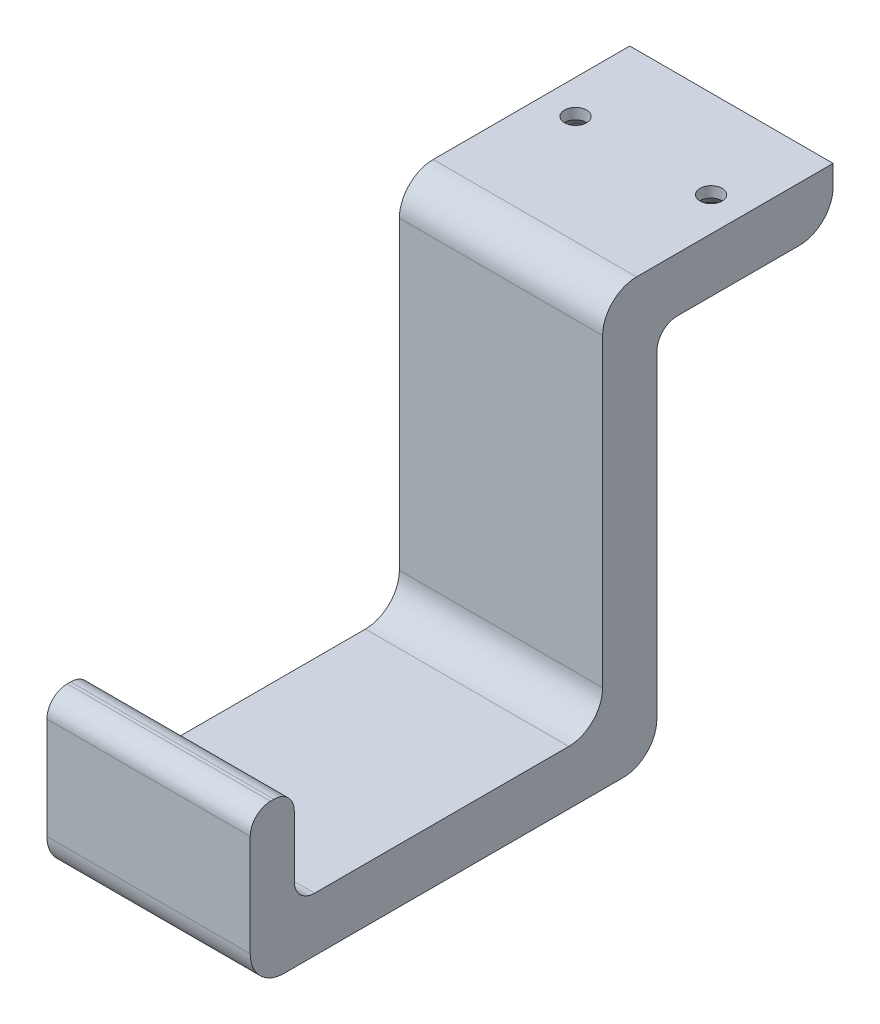
ISO-10303-21;
HEADER;
FILE_DESCRIPTION(('STEP AP214'),'2;1');
FILE_NAME('part.step','',(''),(''),'','','');
FILE_SCHEMA(('AUTOMOTIVE_DESIGN { 1 0 10303 214 1 1 1 1 }'));
ENDSEC;
DATA;
#1=APPLICATION_CONTEXT('core data for automotive mechanical design processes');
#2=APPLICATION_PROTOCOL_DEFINITION('international standard','automotive_design',2000,#1);
#3=PRODUCT_CONTEXT('',#1,'mechanical');
#4=PRODUCT('Part','Part','',(#3));
#5=PRODUCT_RELATED_PRODUCT_CATEGORY('part','',(#4));
#6=PRODUCT_DEFINITION_FORMATION('','',#4);
#7=PRODUCT_DEFINITION_CONTEXT('part definition',#1,'design');
#8=PRODUCT_DEFINITION('design','',#6,#7);
#9=PRODUCT_DEFINITION_SHAPE('','',#8);
#10=(LENGTH_UNIT() NAMED_UNIT(*) SI_UNIT(.MILLI.,.METRE.));
#11=(NAMED_UNIT(*) PLANE_ANGLE_UNIT() SI_UNIT($,.RADIAN.));
#12=(NAMED_UNIT(*) SI_UNIT($,.STERADIAN.) SOLID_ANGLE_UNIT());
#13=UNCERTAINTY_MEASURE_WITH_UNIT(LENGTH_MEASURE(1.E-05),#10,'distance_accuracy_value','');
#14=(GEOMETRIC_REPRESENTATION_CONTEXT(3) GLOBAL_UNCERTAINTY_ASSIGNED_CONTEXT((#13)) GLOBAL_UNIT_ASSIGNED_CONTEXT((#10,
#11,#12)) REPRESENTATION_CONTEXT('',''));
#15=CARTESIAN_POINT('',(0.,0.,0.));
#16=DIRECTION('',(0.,0.,1.));
#17=DIRECTION('',(1.,0.,0.));
#18=AXIS2_PLACEMENT_3D('',#15,#16,#17);
#19=CARTESIAN_POINT('',(15.,0.,60.));
#20=DIRECTION('',(0.,0.,-1.));
#21=DIRECTION('',(-1.,0.,0.));
#22=AXIS2_PLACEMENT_3D('',#19,#20,#21);
#23=PLANE('',#22);
#24=DIRECTION('',(0.,-1.,0.));
#25=VECTOR('',#24,1.);
#26=CARTESIAN_POINT('',(15.,0.,60.));
#27=LINE('',#26,#25);
#28=CARTESIAN_POINT('',(15.,20.,60.));
#29=VERTEX_POINT('',#28);
#30=CARTESIAN_POINT('',(15.,5.,60.));
#31=VERTEX_POINT('',#30);
#32=EDGE_CURVE('E232',#29,#31,#27,.T.);
#33=ORIENTED_EDGE('',*,*,#32,.F.);
#34=DIRECTION('',(-1.,0.,0.));
#35=VECTOR('',#34,1.);
#36=CARTESIAN_POINT('',(15.,20.,60.));
#37=LINE('',#36,#35);
#38=CARTESIAN_POINT('',(-15.,20.,60.));
#39=VERTEX_POINT('',#38);
#40=EDGE_CURVE('E304',#29,#39,#37,.T.);
#41=ORIENTED_EDGE('',*,*,#40,.T.);
#42=DIRECTION('',(0.,-1.,0.));
#43=VECTOR('',#42,1.);
#44=CARTESIAN_POINT('',(-15.,0.,60.));
#45=LINE('',#44,#43);
#46=CARTESIAN_POINT('',(-15.,5.,60.));
#47=VERTEX_POINT('',#46);
#48=EDGE_CURVE('E208',#39,#47,#45,.T.);
#49=ORIENTED_EDGE('',*,*,#48,.T.);
#50=DIRECTION('',(-1.,0.,0.));
#51=VECTOR('',#50,1.);
#52=CARTESIAN_POINT('',(15.,5.,60.));
#53=LINE('',#52,#51);
#54=EDGE_CURVE('E273',#47,#31,#53,.F.);
#55=ORIENTED_EDGE('',*,*,#54,.T.);
#56=EDGE_LOOP('',(#33,#41,#49,#55));
#57=FACE_BOUND('',#56,.T.);
#58=ADVANCED_FACE('F39',(#57),#23,.F.);
#59=CARTESIAN_POINT('',(15.,0.,60.));
#60=DIRECTION('',(0.,1.,0.));
#61=DIRECTION('',(0.,0.,1.));
#62=AXIS2_PLACEMENT_3D('',#59,#60,#61);
#63=PLANE('',#62);
#64=DIRECTION('',(0.,0.,-1.));
#65=VECTOR('',#64,1.);
#66=CARTESIAN_POINT('',(-15.,0.,60.));
#67=LINE('',#66,#65);
#68=CARTESIAN_POINT('',(-15.,0.,55.));
#69=VERTEX_POINT('',#68);
#70=CARTESIAN_POINT('',(-15.,0.,5.));
#71=VERTEX_POINT('',#70);
#72=EDGE_CURVE('E215',#69,#71,#67,.T.);
#73=ORIENTED_EDGE('',*,*,#72,.T.);
#74=DIRECTION('',(-1.,0.,0.));
#75=VECTOR('',#74,1.);
#76=CARTESIAN_POINT('',(15.,0.,5.));
#77=LINE('',#76,#75);
#78=CARTESIAN_POINT('',(15.,0.,5.));
#79=VERTEX_POINT('',#78);
#80=EDGE_CURVE('E271',#71,#79,#77,.F.);
#81=ORIENTED_EDGE('',*,*,#80,.T.);
#82=DIRECTION('',(0.,0.,-1.));
#83=VECTOR('',#82,1.);
#84=CARTESIAN_POINT('',(15.,0.,60.));
#85=LINE('',#84,#83);
#86=CARTESIAN_POINT('',(15.,0.,55.));
#87=VERTEX_POINT('',#86);
#88=EDGE_CURVE('E330',#87,#79,#85,.T.);
#89=ORIENTED_EDGE('',*,*,#88,.F.);
#90=DIRECTION('',(-1.,0.,0.));
#91=VECTOR('',#90,1.);
#92=CARTESIAN_POINT('',(15.,0.,55.));
#93=LINE('',#92,#91);
#94=EDGE_CURVE('E269',#87,#69,#93,.T.);
#95=ORIENTED_EDGE('',*,*,#94,.T.);
#96=EDGE_LOOP('',(#73,#81,#89,#95));
#97=FACE_BOUND('',#96,.T.);
#98=ADVANCED_FACE('F383',(#97),#63,.F.);
#99=CARTESIAN_POINT('',(15.,0.,0.));
#100=DIRECTION('',(0.,0.,1.));
#101=DIRECTION('',(0.,-1.,0.));
#102=AXIS2_PLACEMENT_3D('',#99,#100,#101);
#103=PLANE('',#102);
#104=DIRECTION('',(0.,1.,0.));
#105=VECTOR('',#104,1.);
#106=CARTESIAN_POINT('',(-15.,0.,0.));
#107=LINE('',#106,#105);
#108=CARTESIAN_POINT('',(-15.,5.,0.));
#109=VERTEX_POINT('',#108);
#110=CARTESIAN_POINT('',(-15.,52.,0.));
#111=VERTEX_POINT('',#110);
#112=EDGE_CURVE('E216',#109,#111,#107,.T.);
#113=ORIENTED_EDGE('',*,*,#112,.T.);
#114=DIRECTION('',(-1.,0.,0.));
#115=VECTOR('',#114,1.);
#116=CARTESIAN_POINT('',(15.,52.,0.));
#117=LINE('',#116,#115);
#118=CARTESIAN_POINT('',(15.,52.,0.));
#119=VERTEX_POINT('',#118);
#120=EDGE_CURVE('E292',#111,#119,#117,.F.);
#121=ORIENTED_EDGE('',*,*,#120,.T.);
#122=DIRECTION('',(0.,1.,0.));
#123=VECTOR('',#122,1.);
#124=CARTESIAN_POINT('',(15.,0.,0.));
#125=LINE('',#124,#123);
#126=CARTESIAN_POINT('',(15.,5.,0.));
#127=VERTEX_POINT('',#126);
#128=EDGE_CURVE('E326',#127,#119,#125,.T.);
#129=ORIENTED_EDGE('',*,*,#128,.F.);
#130=DIRECTION('',(-1.,0.,0.));
#131=VECTOR('',#130,1.);
#132=CARTESIAN_POINT('',(15.,5.,0.));
#133=LINE('',#132,#131);
#134=EDGE_CURVE('E270',#127,#109,#133,.T.);
#135=ORIENTED_EDGE('',*,*,#134,.T.);
#136=EDGE_LOOP('',(#113,#121,#129,#135));
#137=FACE_BOUND('',#136,.T.);
#138=ADVANCED_FACE('F316',(#137),#103,.F.);
#139=CARTESIAN_POINT('',(15.,55.,0.));
#140=DIRECTION('',(0.,1.,0.));
#141=DIRECTION('',(0.,0.,1.));
#142=AXIS2_PLACEMENT_3D('',#139,#140,#141);
#143=PLANE('',#142);
#144=CARTESIAN_POINT('',(-10.,55.,-13.));
#145=DIRECTION('',(0.,-1.,0.));
#146=DIRECTION('',(0.,0.,-1.));
#147=AXIS2_PLACEMENT_3D('',#144,#145,#146);
#148=CIRCLE('',#147,2.857501397);
#149=CARTESIAN_POINT('',(-10.,55.,-15.857501397));
#150=VERTEX_POINT('',#149);
#151=EDGE_CURVE('E358',#150,#150,#148,.T.);
#152=ORIENTED_EDGE('',*,*,#151,.F.);
#153=EDGE_LOOP('',(#152));
#154=FACE_BOUND('',#153,.T.);
#155=CARTESIAN_POINT('',(10.,55.,-13.));
#156=DIRECTION('',(0.,-1.,0.));
#157=DIRECTION('',(0.,0.,-1.));
#158=AXIS2_PLACEMENT_3D('',#155,#156,#157);
#159=CIRCLE('',#158,2.857501397);
#160=CARTESIAN_POINT('',(10.,55.,-15.857501397));
#161=VERTEX_POINT('',#160);
#162=EDGE_CURVE('E341',#161,#161,#159,.T.);
#163=ORIENTED_EDGE('',*,*,#162,.F.);
#164=EDGE_LOOP('',(#163));
#165=FACE_BOUND('',#164,.T.);
#166=DIRECTION('',(0.,0.,-1.));
#167=VECTOR('',#166,1.);
#168=CARTESIAN_POINT('',(15.,55.,0.));
#169=LINE('',#168,#167);
#170=CARTESIAN_POINT('',(15.,55.,-3.));
#171=VERTEX_POINT('',#170);
#172=CARTESIAN_POINT('',(15.,55.,-21.));
#173=VERTEX_POINT('',#172);
#174=EDGE_CURVE('E185',#171,#173,#169,.T.);
#175=ORIENTED_EDGE('',*,*,#174,.F.);
#176=DIRECTION('',(-1.,0.,0.));
#177=VECTOR('',#176,1.);
#178=CARTESIAN_POINT('',(-15.,55.,-3.));
#179=LINE('',#178,#177);
#180=CARTESIAN_POINT('',(-15.,55.,-3.));
#181=VERTEX_POINT('',#180);
#182=EDGE_CURVE('E287',#171,#181,#179,.T.);
#183=ORIENTED_EDGE('',*,*,#182,.T.);
#184=DIRECTION('',(0.,0.,-1.));
#185=VECTOR('',#184,1.);
#186=CARTESIAN_POINT('',(-15.,55.,0.));
#187=LINE('',#186,#185);
#188=CARTESIAN_POINT('',(-15.,55.,-21.));
#189=VERTEX_POINT('',#188);
#190=EDGE_CURVE('E218',#181,#189,#187,.T.);
#191=ORIENTED_EDGE('',*,*,#190,.T.);
#192=DIRECTION('',(-1.,0.,0.));
#193=VECTOR('',#192,1.);
#194=CARTESIAN_POINT('',(15.,55.,-21.));
#195=LINE('',#194,#193);
#196=EDGE_CURVE('E257',#189,#173,#195,.F.);
#197=ORIENTED_EDGE('',*,*,#196,.T.);
#198=EDGE_LOOP('',(#175,#183,#191,#197));
#199=FACE_BOUND('',#198,.T.);
#200=ADVANCED_FACE('F329',(#154,#165,#199),#143,.F.);
#201=CARTESIAN_POINT('',(15.,63.,-26.));
#202=DIRECTION('',(0.,0.,1.));
#203=DIRECTION('',(1.,0.,0.));
#204=AXIS2_PLACEMENT_3D('',#201,#202,#203);
#205=PLANE('',#204);
#206=DIRECTION('',(0.,1.,0.));
#207=VECTOR('',#206,1.);
#208=CARTESIAN_POINT('',(15.,63.,-26.));
#209=LINE('',#208,#207);
#210=CARTESIAN_POINT('',(15.,60.,-26.));
#211=VERTEX_POINT('',#210);
#212=CARTESIAN_POINT('',(15.,63.,-26.));
#213=VERTEX_POINT('',#212);
#214=EDGE_CURVE('E167',#211,#213,#209,.T.);
#215=ORIENTED_EDGE('',*,*,#214,.F.);
#216=DIRECTION('',(-1.,0.,0.));
#217=VECTOR('',#216,1.);
#218=CARTESIAN_POINT('',(15.,60.,-26.));
#219=LINE('',#218,#217);
#220=CARTESIAN_POINT('',(-15.,60.,-26.));
#221=VERTEX_POINT('',#220);
#222=EDGE_CURVE('E242',#211,#221,#219,.T.);
#223=ORIENTED_EDGE('',*,*,#222,.T.);
#224=DIRECTION('',(0.,1.,0.));
#225=VECTOR('',#224,1.);
#226=CARTESIAN_POINT('',(-15.,63.,-26.));
#227=LINE('',#226,#225);
#228=CARTESIAN_POINT('',(-15.,63.,-26.));
#229=VERTEX_POINT('',#228);
#230=EDGE_CURVE('E189',#221,#229,#227,.T.);
#231=ORIENTED_EDGE('',*,*,#230,.T.);
#232=DIRECTION('',(-1.,0.,0.));
#233=VECTOR('',#232,1.);
#234=CARTESIAN_POINT('',(15.,63.,-26.));
#235=LINE('',#234,#233);
#236=EDGE_CURVE('E184',#213,#229,#235,.T.);
#237=ORIENTED_EDGE('',*,*,#236,.F.);
#238=EDGE_LOOP('',(#215,#223,#231,#237));
#239=FACE_BOUND('',#238,.T.);
#240=ADVANCED_FACE('F187',(#239),#205,.F.);
#241=CARTESIAN_POINT('',(15.,63.,8.));
#242=DIRECTION('',(0.,-1.,0.));
#243=DIRECTION('',(0.,0.,-1.));
#244=AXIS2_PLACEMENT_3D('',#241,#242,#243);
#245=PLANE('',#244);
#246=CARTESIAN_POINT('',(-10.,63.,-13.));
#247=DIRECTION('',(0.,-1.,0.));
#248=DIRECTION('',(0.,0.,-1.));
#249=AXIS2_PLACEMENT_3D('',#246,#247,#248);
#250=CIRCLE('',#249,1.63195);
#251=CARTESIAN_POINT('',(-10.,63.,-14.63195));
#252=VERTEX_POINT('',#251);
#253=EDGE_CURVE('E347',#252,#252,#250,.T.);
#254=ORIENTED_EDGE('',*,*,#253,.T.);
#255=EDGE_LOOP('',(#254));
#256=FACE_BOUND('',#255,.T.);
#257=CARTESIAN_POINT('',(10.,63.,-13.));
#258=DIRECTION('',(0.,-1.,0.));
#259=DIRECTION('',(0.,0.,-1.));
#260=AXIS2_PLACEMENT_3D('',#257,#258,#259);
#261=CIRCLE('',#260,1.63195);
#262=CARTESIAN_POINT('',(10.,63.,-14.63195));
#263=VERTEX_POINT('',#262);
#264=EDGE_CURVE('E214',#263,#263,#261,.T.);
#265=ORIENTED_EDGE('',*,*,#264,.T.);
#266=EDGE_LOOP('',(#265));
#267=FACE_BOUND('',#266,.T.);
#268=DIRECTION('',(0.,0.,1.));
#269=VECTOR('',#268,1.);
#270=CARTESIAN_POINT('',(-15.,63.,8.));
#271=LINE('',#270,#269);
#272=CARTESIAN_POINT('',(-15.,63.,3.));
#273=VERTEX_POINT('',#272);
#274=EDGE_CURVE('E225',#229,#273,#271,.T.);
#275=ORIENTED_EDGE('',*,*,#274,.T.);
#276=DIRECTION('',(-1.,0.,0.));
#277=VECTOR('',#276,1.);
#278=CARTESIAN_POINT('',(15.,63.,3.));
#279=LINE('',#278,#277);
#280=CARTESIAN_POINT('',(15.,63.,3.));
#281=VERTEX_POINT('',#280);
#282=EDGE_CURVE('E197',#273,#281,#279,.F.);
#283=ORIENTED_EDGE('',*,*,#282,.T.);
#284=DIRECTION('',(0.,0.,1.));
#285=VECTOR('',#284,1.);
#286=CARTESIAN_POINT('',(15.,63.,8.));
#287=LINE('',#286,#285);
#288=EDGE_CURVE('E174',#213,#281,#287,.T.);
#289=ORIENTED_EDGE('',*,*,#288,.F.);
#290=ORIENTED_EDGE('',*,*,#236,.T.);
#291=EDGE_LOOP('',(#275,#283,#289,#290));
#292=FACE_BOUND('',#291,.T.);
#293=ADVANCED_FACE('F193',(#256,#267,#292),#245,.F.);
#294=CARTESIAN_POINT('',(15.,8.,8.));
#295=DIRECTION('',(0.,0.,-1.));
#296=DIRECTION('',(-1.,0.,0.));
#297=AXIS2_PLACEMENT_3D('',#294,#295,#296);
#298=PLANE('',#297);
#299=DIRECTION('',(0.,-1.,0.));
#300=VECTOR('',#299,1.);
#301=CARTESIAN_POINT('',(-15.,8.,8.));
#302=LINE('',#301,#300);
#303=CARTESIAN_POINT('',(-15.,58.,8.));
#304=VERTEX_POINT('',#303);
#305=CARTESIAN_POINT('',(-15.,13.,8.));
#306=VERTEX_POINT('',#305);
#307=EDGE_CURVE('E222',#304,#306,#302,.T.);
#308=ORIENTED_EDGE('',*,*,#307,.T.);
#309=DIRECTION('',(-1.,0.,0.));
#310=VECTOR('',#309,1.);
#311=CARTESIAN_POINT('',(15.,13.,8.));
#312=LINE('',#311,#310);
#313=CARTESIAN_POINT('',(15.,13.,8.));
#314=VERTEX_POINT('',#313);
#315=EDGE_CURVE('E245',#306,#314,#312,.F.);
#316=ORIENTED_EDGE('',*,*,#315,.T.);
#317=DIRECTION('',(0.,-1.,0.));
#318=VECTOR('',#317,1.);
#319=CARTESIAN_POINT('',(15.,8.,8.));
#320=LINE('',#319,#318);
#321=CARTESIAN_POINT('',(15.,58.,8.));
#322=VERTEX_POINT('',#321);
#323=EDGE_CURVE('E199',#322,#314,#320,.T.);
#324=ORIENTED_EDGE('',*,*,#323,.F.);
#325=DIRECTION('',(-1.,0.,0.));
#326=VECTOR('',#325,1.);
#327=CARTESIAN_POINT('',(15.,58.,8.));
#328=LINE('',#327,#326);
#329=EDGE_CURVE('E237',#322,#304,#328,.T.);
#330=ORIENTED_EDGE('',*,*,#329,.T.);
#331=EDGE_LOOP('',(#308,#316,#324,#330));
#332=FACE_BOUND('',#331,.T.);
#333=ADVANCED_FACE('F457',(#332),#298,.F.);
#334=CARTESIAN_POINT('',(15.,8.,53.5));
#335=DIRECTION('',(0.,-1.,0.));
#336=DIRECTION('',(0.,0.,-1.));
#337=AXIS2_PLACEMENT_3D('',#334,#335,#336);
#338=PLANE('',#337);
#339=DIRECTION('',(0.,0.,1.));
#340=VECTOR('',#339,1.);
#341=CARTESIAN_POINT('',(-15.,8.,53.5));
#342=LINE('',#341,#340);
#343=CARTESIAN_POINT('',(-15.,8.,13.));
#344=VERTEX_POINT('',#343);
#345=CARTESIAN_POINT('',(-15.,8.,50.5));
#346=VERTEX_POINT('',#345);
#347=EDGE_CURVE('E227',#344,#346,#342,.T.);
#348=ORIENTED_EDGE('',*,*,#347,.T.);
#349=DIRECTION('',(-1.,0.,0.));
#350=VECTOR('',#349,1.);
#351=CARTESIAN_POINT('',(15.,8.,50.5));
#352=LINE('',#351,#350);
#353=CARTESIAN_POINT('',(15.,8.,50.5));
#354=VERTEX_POINT('',#353);
#355=EDGE_CURVE('E290',#346,#354,#352,.F.);
#356=ORIENTED_EDGE('',*,*,#355,.T.);
#357=DIRECTION('',(0.,0.,1.));
#358=VECTOR('',#357,1.);
#359=CARTESIAN_POINT('',(15.,8.,53.5));
#360=LINE('',#359,#358);
#361=CARTESIAN_POINT('',(15.,8.,13.));
#362=VERTEX_POINT('',#361);
#363=EDGE_CURVE('E203',#362,#354,#360,.T.);
#364=ORIENTED_EDGE('',*,*,#363,.F.);
#365=DIRECTION('',(-1.,0.,0.));
#366=VECTOR('',#365,1.);
#367=CARTESIAN_POINT('',(-15.,8.,13.));
#368=LINE('',#367,#366);
#369=EDGE_CURVE('E195',#362,#344,#368,.T.);
#370=ORIENTED_EDGE('',*,*,#369,.T.);
#371=EDGE_LOOP('',(#348,#356,#364,#370));
#372=FACE_BOUND('',#371,.T.);
#373=ADVANCED_FACE('F448',(#372),#338,.F.);
#374=CARTESIAN_POINT('',(15.,23.,53.5));
#375=DIRECTION('',(0.,0.,1.));
#376=DIRECTION('',(1.,0.,0.));
#377=AXIS2_PLACEMENT_3D('',#374,#375,#376);
#378=PLANE('',#377);
#379=DIRECTION('',(0.,1.,0.));
#380=VECTOR('',#379,1.);
#381=CARTESIAN_POINT('',(15.,23.,53.5));
#382=LINE('',#381,#380);
#383=CARTESIAN_POINT('',(15.,11.,53.5));
#384=VERTEX_POINT('',#383);
#385=CARTESIAN_POINT('',(15.,20.,53.5));
#386=VERTEX_POINT('',#385);
#387=EDGE_CURVE('E210',#384,#386,#382,.T.);
#388=ORIENTED_EDGE('',*,*,#387,.F.);
#389=DIRECTION('',(-1.,0.,0.));
#390=VECTOR('',#389,1.);
#391=CARTESIAN_POINT('',(-15.,11.,53.5));
#392=LINE('',#391,#390);
#393=CARTESIAN_POINT('',(-15.,11.,53.5));
#394=VERTEX_POINT('',#393);
#395=EDGE_CURVE('E283',#384,#394,#392,.T.);
#396=ORIENTED_EDGE('',*,*,#395,.T.);
#397=DIRECTION('',(0.,1.,0.));
#398=VECTOR('',#397,1.);
#399=CARTESIAN_POINT('',(-15.,23.,53.5));
#400=LINE('',#399,#398);
#401=CARTESIAN_POINT('',(-15.,20.,53.5));
#402=VERTEX_POINT('',#401);
#403=EDGE_CURVE('E229',#394,#402,#400,.T.);
#404=ORIENTED_EDGE('',*,*,#403,.T.);
#405=DIRECTION('',(-1.,0.,0.));
#406=VECTOR('',#405,1.);
#407=CARTESIAN_POINT('',(15.,20.,53.5));
#408=LINE('',#407,#406);
#409=EDGE_CURVE('E282',#402,#386,#408,.F.);
#410=ORIENTED_EDGE('',*,*,#409,.T.);
#411=EDGE_LOOP('',(#388,#396,#404,#410));
#412=FACE_BOUND('',#411,.T.);
#413=ADVANCED_FACE('F443',(#412),#378,.F.);
#414=CARTESIAN_POINT('',(15.,23.,60.));
#415=DIRECTION('',(0.,-1.,0.));
#416=DIRECTION('',(0.,0.,-1.));
#417=AXIS2_PLACEMENT_3D('',#414,#415,#416);
#418=PLANE('',#417);
#419=DIRECTION('',(0.,0.,1.));
#420=VECTOR('',#419,1.);
#421=CARTESIAN_POINT('',(15.,23.,60.));
#422=LINE('',#421,#420);
#423=CARTESIAN_POINT('',(15.,23.,56.5));
#424=VERTEX_POINT('',#423);
#425=CARTESIAN_POINT('',(15.,23.,57.));
#426=VERTEX_POINT('',#425);
#427=EDGE_CURVE('E194',#424,#426,#422,.T.);
#428=ORIENTED_EDGE('',*,*,#427,.F.);
#429=DIRECTION('',(-1.,0.,0.));
#430=VECTOR('',#429,1.);
#431=CARTESIAN_POINT('',(15.,23.,56.5));
#432=LINE('',#431,#430);
#433=CARTESIAN_POINT('',(-15.,23.,56.5));
#434=VERTEX_POINT('',#433);
#435=EDGE_CURVE('E298',#424,#434,#432,.T.);
#436=ORIENTED_EDGE('',*,*,#435,.T.);
#437=DIRECTION('',(0.,0.,1.));
#438=VECTOR('',#437,1.);
#439=CARTESIAN_POINT('',(-15.,23.,60.));
#440=LINE('',#439,#438);
#441=CARTESIAN_POINT('',(-15.,23.,57.));
#442=VERTEX_POINT('',#441);
#443=EDGE_CURVE('E231',#434,#442,#440,.T.);
#444=ORIENTED_EDGE('',*,*,#443,.T.);
#445=DIRECTION('',(-1.,0.,0.));
#446=VECTOR('',#445,1.);
#447=CARTESIAN_POINT('',(15.,23.,57.));
#448=LINE('',#447,#446);
#449=EDGE_CURVE('E295',#442,#426,#448,.F.);
#450=ORIENTED_EDGE('',*,*,#449,.T.);
#451=EDGE_LOOP('',(#428,#436,#444,#450));
#452=FACE_BOUND('',#451,.T.);
#453=ADVANCED_FACE('F433',(#452),#418,.F.);
#454=CARTESIAN_POINT('',(15.,0.,0.));
#455=DIRECTION('',(-1.,0.,0.));
#456=DIRECTION('',(0.,0.,1.));
#457=AXIS2_PLACEMENT_3D('',#454,#455,#456);
#458=PLANE('',#457);
#459=ORIENTED_EDGE('',*,*,#387,.T.);
#460=CARTESIAN_POINT('',(15.,20.,56.5));
#461=DIRECTION('',(-1.,0.,0.));
#462=DIRECTION('',(0.,0.,1.));
#463=AXIS2_PLACEMENT_3D('',#460,#461,#462);
#464=CIRCLE('',#463,3.);
#465=EDGE_CURVE('E303',#386,#424,#464,.F.);
#466=ORIENTED_EDGE('',*,*,#465,.T.);
#467=ORIENTED_EDGE('',*,*,#427,.T.);
#468=CARTESIAN_POINT('',(15.,20.,57.));
#469=DIRECTION('',(-1.,0.,0.));
#470=DIRECTION('',(0.,0.,1.));
#471=AXIS2_PLACEMENT_3D('',#468,#469,#470);
#472=CIRCLE('',#471,3.);
#473=EDGE_CURVE('E53',#426,#29,#472,.F.);
#474=ORIENTED_EDGE('',*,*,#473,.T.);
#475=ORIENTED_EDGE('',*,*,#32,.T.);
#476=CARTESIAN_POINT('',(15.,5.,55.));
#477=DIRECTION('',(-1.,0.,0.));
#478=DIRECTION('',(0.,0.,1.));
#479=AXIS2_PLACEMENT_3D('',#476,#477,#478);
#480=CIRCLE('',#479,5.);
#481=EDGE_CURVE('E256',#31,#87,#480,.F.);
#482=ORIENTED_EDGE('',*,*,#481,.T.);
#483=ORIENTED_EDGE('',*,*,#88,.T.);
#484=CARTESIAN_POINT('',(15.,5.,5.));
#485=DIRECTION('',(-1.,0.,0.));
#486=DIRECTION('',(0.,0.,1.));
#487=AXIS2_PLACEMENT_3D('',#484,#485,#486);
#488=CIRCLE('',#487,5.);
#489=EDGE_CURVE('E261',#79,#127,#488,.F.);
#490=ORIENTED_EDGE('',*,*,#489,.T.);
#491=ORIENTED_EDGE('',*,*,#128,.T.);
#492=CARTESIAN_POINT('',(15.,52.,-3.));
#493=DIRECTION('',(-1.,0.,0.));
#494=DIRECTION('',(0.,0.,1.));
#495=AXIS2_PLACEMENT_3D('',#492,#493,#494);
#496=CIRCLE('',#495,3.);
#497=EDGE_CURVE('E11',#119,#171,#496,.T.);
#498=ORIENTED_EDGE('',*,*,#497,.T.);
#499=ORIENTED_EDGE('',*,*,#174,.T.);
#500=CARTESIAN_POINT('',(15.,60.,-21.));
#501=DIRECTION('',(-1.,0.,0.));
#502=DIRECTION('',(0.,0.,1.));
#503=AXIS2_PLACEMENT_3D('',#500,#501,#502);
#504=CIRCLE('',#503,5.);
#505=EDGE_CURVE('E178',#173,#211,#504,.F.);
#506=ORIENTED_EDGE('',*,*,#505,.T.);
#507=ORIENTED_EDGE('',*,*,#214,.T.);
#508=ORIENTED_EDGE('',*,*,#288,.T.);
#509=CARTESIAN_POINT('',(15.,58.,3.));
#510=DIRECTION('',(-1.,0.,0.));
#511=DIRECTION('',(0.,0.,1.));
#512=AXIS2_PLACEMENT_3D('',#509,#510,#511);
#513=CIRCLE('',#512,5.);
#514=EDGE_CURVE('E264',#281,#322,#513,.F.);
#515=ORIENTED_EDGE('',*,*,#514,.T.);
#516=ORIENTED_EDGE('',*,*,#323,.T.);
#517=CARTESIAN_POINT('',(15.,13.,13.));
#518=DIRECTION('',(-1.,0.,0.));
#519=DIRECTION('',(0.,0.,1.));
#520=AXIS2_PLACEMENT_3D('',#517,#518,#519);
#521=CIRCLE('',#520,5.);
#522=EDGE_CURVE('E278',#314,#362,#521,.T.);
#523=ORIENTED_EDGE('',*,*,#522,.T.);
#524=ORIENTED_EDGE('',*,*,#363,.T.);
#525=CARTESIAN_POINT('',(15.,11.,50.5));
#526=DIRECTION('',(-1.,0.,0.));
#527=DIRECTION('',(0.,0.,1.));
#528=AXIS2_PLACEMENT_3D('',#525,#526,#527);
#529=CIRCLE('',#528,3.);
#530=EDGE_CURVE('E307',#354,#384,#529,.T.);
#531=ORIENTED_EDGE('',*,*,#530,.T.);
#532=EDGE_LOOP('',(#459,#466,#467,#474,#475,#482,#483,#490,#491,#498,#499,#506,#507,#508,#515,
#516,#523,#524,#531));
#533=FACE_BOUND('',#532,.T.);
#534=ADVANCED_FACE('F173',(#533),#458,.F.);
#535=CARTESIAN_POINT('',(-15.,0.,0.));
#536=DIRECTION('',(-1.,0.,0.));
#537=DIRECTION('',(0.,0.,1.));
#538=AXIS2_PLACEMENT_3D('',#535,#536,#537);
#539=PLANE('',#538);
#540=ORIENTED_EDGE('',*,*,#443,.F.);
#541=CARTESIAN_POINT('',(-15.,20.,56.5));
#542=DIRECTION('',(-1.,0.,0.));
#543=DIRECTION('',(0.,0.,1.));
#544=AXIS2_PLACEMENT_3D('',#541,#542,#543);
#545=CIRCLE('',#544,3.);
#546=EDGE_CURVE('E297',#434,#402,#545,.T.);
#547=ORIENTED_EDGE('',*,*,#546,.T.);
#548=ORIENTED_EDGE('',*,*,#403,.F.);
#549=CARTESIAN_POINT('',(-15.,11.,50.5));
#550=DIRECTION('',(-1.,0.,0.));
#551=DIRECTION('',(0.,0.,1.));
#552=AXIS2_PLACEMENT_3D('',#549,#550,#551);
#553=CIRCLE('',#552,3.);
#554=EDGE_CURVE('E310',#394,#346,#553,.F.);
#555=ORIENTED_EDGE('',*,*,#554,.T.);
#556=ORIENTED_EDGE('',*,*,#347,.F.);
#557=CARTESIAN_POINT('',(-15.,13.,13.));
#558=DIRECTION('',(-1.,0.,0.));
#559=DIRECTION('',(0.,0.,1.));
#560=AXIS2_PLACEMENT_3D('',#557,#558,#559);
#561=CIRCLE('',#560,5.);
#562=EDGE_CURVE('E279',#344,#306,#561,.F.);
#563=ORIENTED_EDGE('',*,*,#562,.T.);
#564=ORIENTED_EDGE('',*,*,#307,.F.);
#565=CARTESIAN_POINT('',(-15.,58.,3.));
#566=DIRECTION('',(-1.,0.,0.));
#567=DIRECTION('',(0.,0.,1.));
#568=AXIS2_PLACEMENT_3D('',#565,#566,#567);
#569=CIRCLE('',#568,5.);
#570=EDGE_CURVE('E252',#304,#273,#569,.T.);
#571=ORIENTED_EDGE('',*,*,#570,.T.);
#572=ORIENTED_EDGE('',*,*,#274,.F.);
#573=ORIENTED_EDGE('',*,*,#230,.F.);
#574=CARTESIAN_POINT('',(-15.,60.,-21.));
#575=DIRECTION('',(-1.,0.,0.));
#576=DIRECTION('',(0.,0.,1.));
#577=AXIS2_PLACEMENT_3D('',#574,#575,#576);
#578=CIRCLE('',#577,5.);
#579=EDGE_CURVE('E254',#221,#189,#578,.T.);
#580=ORIENTED_EDGE('',*,*,#579,.T.);
#581=ORIENTED_EDGE('',*,*,#190,.F.);
#582=CARTESIAN_POINT('',(-15.,52.,-3.));
#583=DIRECTION('',(-1.,0.,0.));
#584=DIRECTION('',(0.,0.,1.));
#585=AXIS2_PLACEMENT_3D('',#582,#583,#584);
#586=CIRCLE('',#585,3.);
#587=EDGE_CURVE('E50',#181,#111,#586,.F.);
#588=ORIENTED_EDGE('',*,*,#587,.T.);
#589=ORIENTED_EDGE('',*,*,#112,.F.);
#590=CARTESIAN_POINT('',(-15.,5.,5.));
#591=DIRECTION('',(-1.,0.,0.));
#592=DIRECTION('',(0.,0.,1.));
#593=AXIS2_PLACEMENT_3D('',#590,#591,#592);
#594=CIRCLE('',#593,5.);
#595=EDGE_CURVE('E248',#109,#71,#594,.T.);
#596=ORIENTED_EDGE('',*,*,#595,.T.);
#597=ORIENTED_EDGE('',*,*,#72,.F.);
#598=CARTESIAN_POINT('',(-15.,5.,55.));
#599=DIRECTION('',(-1.,0.,0.));
#600=DIRECTION('',(0.,0.,1.));
#601=AXIS2_PLACEMENT_3D('',#598,#599,#600);
#602=CIRCLE('',#601,5.);
#603=EDGE_CURVE('E246',#69,#47,#602,.T.);
#604=ORIENTED_EDGE('',*,*,#603,.T.);
#605=ORIENTED_EDGE('',*,*,#48,.F.);
#606=CARTESIAN_POINT('',(-15.,20.,57.));
#607=DIRECTION('',(-1.,0.,0.));
#608=DIRECTION('',(0.,0.,1.));
#609=AXIS2_PLACEMENT_3D('',#606,#607,#608);
#610=CIRCLE('',#609,3.);
#611=EDGE_CURVE('E65',#39,#442,#610,.T.);
#612=ORIENTED_EDGE('',*,*,#611,.T.);
#613=EDGE_LOOP('',(#540,#547,#548,#555,#556,#563,#564,#571,#572,#573,#580,#581,#588,#589,#596,
#597,#604,#605,#612));
#614=FACE_BOUND('',#613,.T.);
#615=ADVANCED_FACE('F313',(#614),#539,.T.);
#616=CARTESIAN_POINT('',(15.,13.,13.));
#617=DIRECTION('',(1.,0.,0.));
#618=DIRECTION('',(0.,0.,-1.));
#619=AXIS2_PLACEMENT_3D('',#616,#617,#618);
#620=CYLINDRICAL_SURFACE('',#619,5.);
#621=ORIENTED_EDGE('',*,*,#522,.F.);
#622=ORIENTED_EDGE('',*,*,#315,.F.);
#623=ORIENTED_EDGE('',*,*,#562,.F.);
#624=ORIENTED_EDGE('',*,*,#369,.F.);
#625=EDGE_LOOP('',(#621,#622,#623,#624));
#626=FACE_BOUND('',#625,.T.);
#627=ADVANCED_FACE('F400',(#626),#620,.F.);
#628=CARTESIAN_POINT('',(15.,60.,-21.));
#629=DIRECTION('',(-1.,0.,0.));
#630=DIRECTION('',(0.,0.,1.));
#631=AXIS2_PLACEMENT_3D('',#628,#629,#630);
#632=CYLINDRICAL_SURFACE('',#631,5.);
#633=ORIENTED_EDGE('',*,*,#505,.F.);
#634=ORIENTED_EDGE('',*,*,#196,.F.);
#635=ORIENTED_EDGE('',*,*,#579,.F.);
#636=ORIENTED_EDGE('',*,*,#222,.F.);
#637=EDGE_LOOP('',(#633,#634,#635,#636));
#638=FACE_BOUND('',#637,.T.);
#639=ADVANCED_FACE('F399',(#638),#632,.T.);
#640=CARTESIAN_POINT('',(15.,58.,3.));
#641=DIRECTION('',(-1.,0.,0.));
#642=DIRECTION('',(0.,0.,1.));
#643=AXIS2_PLACEMENT_3D('',#640,#641,#642);
#644=CYLINDRICAL_SURFACE('',#643,5.);
#645=ORIENTED_EDGE('',*,*,#514,.F.);
#646=ORIENTED_EDGE('',*,*,#282,.F.);
#647=ORIENTED_EDGE('',*,*,#570,.F.);
#648=ORIENTED_EDGE('',*,*,#329,.F.);
#649=EDGE_LOOP('',(#645,#646,#647,#648));
#650=FACE_BOUND('',#649,.T.);
#651=ADVANCED_FACE('F404',(#650),#644,.T.);
#652=CARTESIAN_POINT('',(15.,5.,5.));
#653=DIRECTION('',(-1.,0.,0.));
#654=DIRECTION('',(0.,0.,1.));
#655=AXIS2_PLACEMENT_3D('',#652,#653,#654);
#656=CYLINDRICAL_SURFACE('',#655,5.);
#657=ORIENTED_EDGE('',*,*,#489,.F.);
#658=ORIENTED_EDGE('',*,*,#80,.F.);
#659=ORIENTED_EDGE('',*,*,#595,.F.);
#660=ORIENTED_EDGE('',*,*,#134,.F.);
#661=EDGE_LOOP('',(#657,#658,#659,#660));
#662=FACE_BOUND('',#661,.T.);
#663=ADVANCED_FACE('F409',(#662),#656,.T.);
#664=CARTESIAN_POINT('',(15.,5.,55.));
#665=DIRECTION('',(-1.,0.,0.));
#666=DIRECTION('',(0.,0.,1.));
#667=AXIS2_PLACEMENT_3D('',#664,#665,#666);
#668=CYLINDRICAL_SURFACE('',#667,5.);
#669=ORIENTED_EDGE('',*,*,#481,.F.);
#670=ORIENTED_EDGE('',*,*,#54,.F.);
#671=ORIENTED_EDGE('',*,*,#603,.F.);
#672=ORIENTED_EDGE('',*,*,#94,.F.);
#673=EDGE_LOOP('',(#669,#670,#671,#672));
#674=FACE_BOUND('',#673,.T.);
#675=ADVANCED_FACE('F412',(#674),#668,.T.);
#676=CARTESIAN_POINT('',(15.,11.,50.5));
#677=DIRECTION('',(1.,0.,0.));
#678=DIRECTION('',(0.,0.,-1.));
#679=AXIS2_PLACEMENT_3D('',#676,#677,#678);
#680=CYLINDRICAL_SURFACE('',#679,3.);
#681=ORIENTED_EDGE('',*,*,#530,.F.);
#682=ORIENTED_EDGE('',*,*,#355,.F.);
#683=ORIENTED_EDGE('',*,*,#554,.F.);
#684=ORIENTED_EDGE('',*,*,#395,.F.);
#685=EDGE_LOOP('',(#681,#682,#683,#684));
#686=FACE_BOUND('',#685,.T.);
#687=ADVANCED_FACE('F415',(#686),#680,.F.);
#688=CARTESIAN_POINT('',(15.,52.,-3.));
#689=DIRECTION('',(1.,0.,0.));
#690=DIRECTION('',(0.,0.,-1.));
#691=AXIS2_PLACEMENT_3D('',#688,#689,#690);
#692=CYLINDRICAL_SURFACE('',#691,3.);
#693=ORIENTED_EDGE('',*,*,#497,.F.);
#694=ORIENTED_EDGE('',*,*,#120,.F.);
#695=ORIENTED_EDGE('',*,*,#587,.F.);
#696=ORIENTED_EDGE('',*,*,#182,.F.);
#697=EDGE_LOOP('',(#693,#694,#695,#696));
#698=FACE_BOUND('',#697,.T.);
#699=ADVANCED_FACE('F321',(#698),#692,.F.);
#700=CARTESIAN_POINT('',(15.,20.,56.5));
#701=DIRECTION('',(-1.,0.,0.));
#702=DIRECTION('',(0.,0.,1.));
#703=AXIS2_PLACEMENT_3D('',#700,#701,#702);
#704=CYLINDRICAL_SURFACE('',#703,3.);
#705=ORIENTED_EDGE('',*,*,#465,.F.);
#706=ORIENTED_EDGE('',*,*,#409,.F.);
#707=ORIENTED_EDGE('',*,*,#546,.F.);
#708=ORIENTED_EDGE('',*,*,#435,.F.);
#709=EDGE_LOOP('',(#705,#706,#707,#708));
#710=FACE_BOUND('',#709,.T.);
#711=ADVANCED_FACE('F423',(#710),#704,.T.);
#712=CARTESIAN_POINT('',(15.,20.,57.));
#713=DIRECTION('',(-1.,0.,0.));
#714=DIRECTION('',(0.,0.,1.));
#715=AXIS2_PLACEMENT_3D('',#712,#713,#714);
#716=CYLINDRICAL_SURFACE('',#715,3.);
#717=ORIENTED_EDGE('',*,*,#473,.F.);
#718=ORIENTED_EDGE('',*,*,#449,.F.);
#719=ORIENTED_EDGE('',*,*,#611,.F.);
#720=ORIENTED_EDGE('',*,*,#40,.F.);
#721=EDGE_LOOP('',(#717,#718,#719,#720));
#722=FACE_BOUND('',#721,.T.);
#723=ADVANCED_FACE('F41',(#722),#716,.T.);
#724=CARTESIAN_POINT('',(10.,55.,-13.));
#725=DIRECTION('',(0.,-1.,0.));
#726=DIRECTION('',(0.,0.,-1.));
#727=AXIS2_PLACEMENT_3D('',#724,#725,#726);
#728=CYLINDRICAL_SURFACE('',#727,1.63195);
#729=ORIENTED_EDGE('',*,*,#264,.F.);
#730=EDGE_LOOP('',(#729));
#731=FACE_BOUND('',#730,.T.);
#732=CARTESIAN_POINT('',(10.,61.4098356085344,-13.));
#733=DIRECTION('',(0.,-1.,0.));
#734=DIRECTION('',(0.,0.,-1.));
#735=AXIS2_PLACEMENT_3D('',#732,#733,#734);
#736=CIRCLE('',#735,1.63195);
#737=CARTESIAN_POINT('',(10.,61.4098356085344,-14.63195));
#738=VERTEX_POINT('',#737);
#739=EDGE_CURVE('E336',#738,#738,#736,.T.);
#740=ORIENTED_EDGE('',*,*,#739,.T.);
#741=EDGE_LOOP('',(#740));
#742=FACE_BOUND('',#741,.T.);
#743=ADVANCED_FACE('F379',(#731,#742),#728,.F.);
#744=CARTESIAN_POINT('',(10.,60.,-13.));
#745=DIRECTION('',(0.,-1.,0.));
#746=DIRECTION('',(0.,0.,-1.));
#747=AXIS2_PLACEMENT_3D('',#744,#745,#746);
#748=CONICAL_SURFACE('',#747,2.85750139699999,0.715584993317671);
#749=ORIENTED_EDGE('',*,*,#739,.F.);
#750=EDGE_LOOP('',(#749));
#751=FACE_BOUND('',#750,.T.);
#752=CARTESIAN_POINT('',(10.,60.,-13.));
#753=DIRECTION('',(0.,-1.,0.));
#754=DIRECTION('',(0.,0.,-1.));
#755=AXIS2_PLACEMENT_3D('',#752,#753,#754);
#756=CIRCLE('',#755,2.85750139699999);
#757=CARTESIAN_POINT('',(10.,60.,-15.857501397));
#758=VERTEX_POINT('',#757);
#759=EDGE_CURVE('E342',#758,#758,#756,.T.);
#760=ORIENTED_EDGE('',*,*,#759,.T.);
#761=EDGE_LOOP('',(#760));
#762=FACE_BOUND('',#761,.T.);
#763=ADVANCED_FACE('F369',(#751,#762),#748,.F.);
#764=CARTESIAN_POINT('',(10.,55.,-13.));
#765=DIRECTION('',(0.,-1.,0.));
#766=DIRECTION('',(0.,0.,-1.));
#767=AXIS2_PLACEMENT_3D('',#764,#765,#766);
#768=CYLINDRICAL_SURFACE('',#767,2.857501397);
#769=ORIENTED_EDGE('',*,*,#759,.F.);
#770=EDGE_LOOP('',(#769));
#771=FACE_BOUND('',#770,.T.);
#772=ORIENTED_EDGE('',*,*,#162,.T.);
#773=EDGE_LOOP('',(#772));
#774=FACE_BOUND('',#773,.T.);
#775=ADVANCED_FACE('F370',(#771,#774),#768,.F.);
#776=CARTESIAN_POINT('',(-10.,55.,-13.));
#777=DIRECTION('',(0.,-1.,0.));
#778=DIRECTION('',(0.,0.,-1.));
#779=AXIS2_PLACEMENT_3D('',#776,#777,#778);
#780=CYLINDRICAL_SURFACE('',#779,1.63195);
#781=ORIENTED_EDGE('',*,*,#253,.F.);
#782=EDGE_LOOP('',(#781));
#783=FACE_BOUND('',#782,.T.);
#784=CARTESIAN_POINT('',(-10.,61.4098356085344,-13.));
#785=DIRECTION('',(0.,-1.,0.));
#786=DIRECTION('',(0.,0.,-1.));
#787=AXIS2_PLACEMENT_3D('',#784,#785,#786);
#788=CIRCLE('',#787,1.63195);
#789=CARTESIAN_POINT('',(-10.,61.4098356085344,-14.63195));
#790=VERTEX_POINT('',#789);
#791=EDGE_CURVE('E350',#790,#790,#788,.T.);
#792=ORIENTED_EDGE('',*,*,#791,.T.);
#793=EDGE_LOOP('',(#792));
#794=FACE_BOUND('',#793,.T.);
#795=ADVANCED_FACE('F367',(#783,#794),#780,.F.);
#796=CARTESIAN_POINT('',(-10.,60.,-13.));
#797=DIRECTION('',(0.,-1.,0.));
#798=DIRECTION('',(0.,0.,-1.));
#799=AXIS2_PLACEMENT_3D('',#796,#797,#798);
#800=CONICAL_SURFACE('',#799,2.85750139699999,0.715584993317671);
#801=ORIENTED_EDGE('',*,*,#791,.F.);
#802=EDGE_LOOP('',(#801));
#803=FACE_BOUND('',#802,.T.);
#804=CARTESIAN_POINT('',(-10.,60.,-13.));
#805=DIRECTION('',(0.,-1.,0.));
#806=DIRECTION('',(0.,0.,-1.));
#807=AXIS2_PLACEMENT_3D('',#804,#805,#806);
#808=CIRCLE('',#807,2.85750139699999);
#809=CARTESIAN_POINT('',(-10.,60.,-15.857501397));
#810=VERTEX_POINT('',#809);
#811=EDGE_CURVE('E351',#810,#810,#808,.T.);
#812=ORIENTED_EDGE('',*,*,#811,.T.);
#813=EDGE_LOOP('',(#812));
#814=FACE_BOUND('',#813,.T.);
#815=ADVANCED_FACE('F380',(#803,#814),#800,.F.);
#816=CARTESIAN_POINT('',(-10.,55.,-13.));
#817=DIRECTION('',(0.,-1.,0.));
#818=DIRECTION('',(0.,0.,-1.));
#819=AXIS2_PLACEMENT_3D('',#816,#817,#818);
#820=CYLINDRICAL_SURFACE('',#819,2.857501397);
#821=ORIENTED_EDGE('',*,*,#811,.F.);
#822=EDGE_LOOP('',(#821));
#823=FACE_BOUND('',#822,.T.);
#824=ORIENTED_EDGE('',*,*,#151,.T.);
#825=EDGE_LOOP('',(#824));
#826=FACE_BOUND('',#825,.T.);
#827=ADVANCED_FACE('F359',(#823,#826),#820,.F.);
#828=CLOSED_SHELL('',(#58,#98,#138,#200,#240,#293,#333,#373,#413,#453,#534,#615,#627,#639,#651,
#663,#675,#687,#699,#711,#723,#743,#763,#775,#795,#815,#827));
#829=MANIFOLD_SOLID_BREP('B2',#828);
#830=ADVANCED_BREP_SHAPE_REPRESENTATION('',(#18,#829),#14);
#831=SHAPE_DEFINITION_REPRESENTATION(#9,#830);
ENDSEC;
END-ISO-10303-21;
